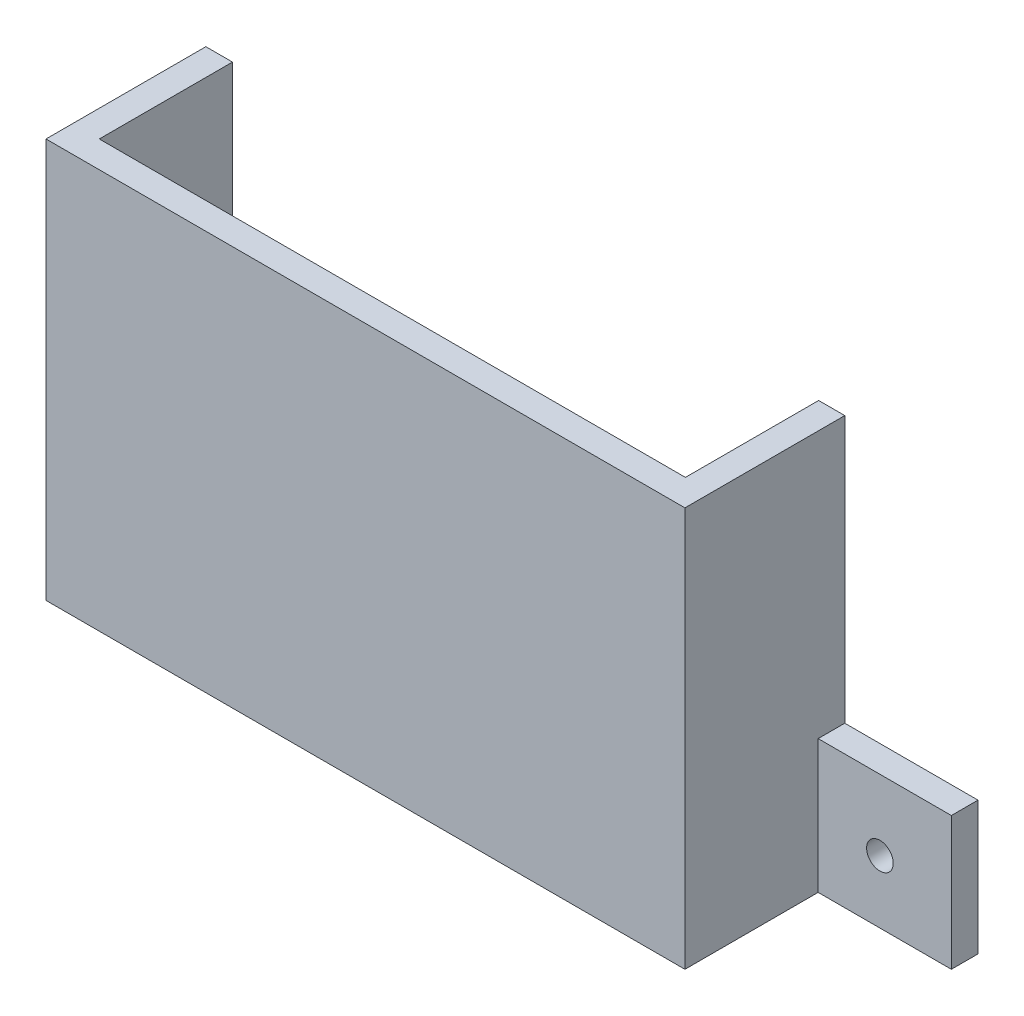
ISO-10303-21;
HEADER;
FILE_DESCRIPTION(('STEP AP214'),'2;1');
FILE_NAME('part.step','',(''),(''),'','','');
FILE_SCHEMA(('AUTOMOTIVE_DESIGN { 1 0 10303 214 1 1 1 1 }'));
ENDSEC;
DATA;
#1=APPLICATION_CONTEXT('core data for automotive mechanical design processes');
#2=APPLICATION_PROTOCOL_DEFINITION('international standard','automotive_design',2000,#1);
#3=PRODUCT_CONTEXT('',#1,'mechanical');
#4=PRODUCT('Part','Part','',(#3));
#5=PRODUCT_RELATED_PRODUCT_CATEGORY('part','',(#4));
#6=PRODUCT_DEFINITION_FORMATION('','',#4);
#7=PRODUCT_DEFINITION_CONTEXT('part definition',#1,'design');
#8=PRODUCT_DEFINITION('design','',#6,#7);
#9=PRODUCT_DEFINITION_SHAPE('','',#8);
#10=(LENGTH_UNIT() NAMED_UNIT(*) SI_UNIT(.MILLI.,.METRE.));
#11=(NAMED_UNIT(*) PLANE_ANGLE_UNIT() SI_UNIT($,.RADIAN.));
#12=(NAMED_UNIT(*) SI_UNIT($,.STERADIAN.) SOLID_ANGLE_UNIT());
#13=UNCERTAINTY_MEASURE_WITH_UNIT(LENGTH_MEASURE(1.E-05),#10,'distance_accuracy_value','');
#14=(GEOMETRIC_REPRESENTATION_CONTEXT(3) GLOBAL_UNCERTAINTY_ASSIGNED_CONTEXT((#13)) GLOBAL_UNIT_ASSIGNED_CONTEXT((#10,
#11,#12)) REPRESENTATION_CONTEXT('',''));
#15=CARTESIAN_POINT('',(0.,0.,0.));
#16=DIRECTION('',(0.,0.,1.));
#17=DIRECTION('',(1.,0.,0.));
#18=AXIS2_PLACEMENT_3D('',#15,#16,#17);
#19=CARTESIAN_POINT('',(7.43671578947368,9.99999999999999,-10.));
#20=DIRECTION('',(0.,1.,0.));
#21=DIRECTION('',(0.,0.,1.));
#22=AXIS2_PLACEMENT_3D('',#19,#20,#21);
#23=PLANE('',#22);
#24=DIRECTION('',(0.,0.,1.));
#25=VECTOR('',#24,1.);
#26=CARTESIAN_POINT('',(7.43671578947368,9.99999999999999,-10.));
#27=LINE('',#26,#25);
#28=CARTESIAN_POINT('',(7.43671578947368,9.99999999999999,-10.));
#29=VERTEX_POINT('',#28);
#30=CARTESIAN_POINT('',(7.43671578947368,9.99999999999999,-8.));
#31=VERTEX_POINT('',#30);
#32=EDGE_CURVE('E52',#29,#31,#27,.T.);
#33=ORIENTED_EDGE('',*,*,#32,.T.);
#34=DIRECTION('',(-1.,0.,0.));
#35=VECTOR('',#34,1.);
#36=CARTESIAN_POINT('',(7.43671578947368,9.99999999999999,-8.));
#37=LINE('',#36,#35);
#38=CARTESIAN_POINT('',(17.4367157894737,9.99999999999999,-8.));
#39=VERTEX_POINT('',#38);
#40=EDGE_CURVE('E180',#39,#31,#37,.T.);
#41=ORIENTED_EDGE('',*,*,#40,.F.);
#42=DIRECTION('',(0.,0.,1.));
#43=VECTOR('',#42,1.);
#44=CARTESIAN_POINT('',(17.4367157894737,9.99999999999999,-10.));
#45=LINE('',#44,#43);
#46=CARTESIAN_POINT('',(17.4367157894737,9.99999999999999,-10.));
#47=VERTEX_POINT('',#46);
#48=EDGE_CURVE('E206',#47,#39,#45,.T.);
#49=ORIENTED_EDGE('',*,*,#48,.F.);
#50=DIRECTION('',(-1.,0.,0.));
#51=VECTOR('',#50,1.);
#52=CARTESIAN_POINT('',(7.43671578947368,9.99999999999999,-10.));
#53=LINE('',#52,#51);
#54=EDGE_CURVE('E205',#47,#29,#53,.T.);
#55=ORIENTED_EDGE('',*,*,#54,.T.);
#56=EDGE_LOOP('',(#33,#41,#49,#55));
#57=FACE_BOUND('',#56,.T.);
#58=ADVANCED_FACE('F35',(#57),#23,.T.);
#59=CARTESIAN_POINT('',(17.4367157894737,9.99999999999999,-10.));
#60=DIRECTION('',(1.,0.,0.));
#61=DIRECTION('',(0.,0.,-1.));
#62=AXIS2_PLACEMENT_3D('',#59,#60,#61);
#63=PLANE('',#62);
#64=ORIENTED_EDGE('',*,*,#48,.T.);
#65=DIRECTION('',(0.,1.,0.));
#66=VECTOR('',#65,1.);
#67=CARTESIAN_POINT('',(17.4367157894737,9.99999999999999,-8.));
#68=LINE('',#67,#66);
#69=CARTESIAN_POINT('',(17.4367157894737,0.,-8.));
#70=VERTEX_POINT('',#69);
#71=EDGE_CURVE('E187',#70,#39,#68,.T.);
#72=ORIENTED_EDGE('',*,*,#71,.F.);
#73=DIRECTION('',(0.,0.,1.));
#74=VECTOR('',#73,1.);
#75=CARTESIAN_POINT('',(17.4367157894737,0.,-10.));
#76=LINE('',#75,#74);
#77=CARTESIAN_POINT('',(17.4367157894737,0.,-10.));
#78=VERTEX_POINT('',#77);
#79=EDGE_CURVE('E186',#78,#70,#76,.T.);
#80=ORIENTED_EDGE('',*,*,#79,.F.);
#81=DIRECTION('',(0.,1.,0.));
#82=VECTOR('',#81,1.);
#83=CARTESIAN_POINT('',(17.4367157894737,9.99999999999999,-10.));
#84=LINE('',#83,#82);
#85=EDGE_CURVE('E202',#78,#47,#84,.T.);
#86=ORIENTED_EDGE('',*,*,#85,.T.);
#87=EDGE_LOOP('',(#64,#72,#80,#86));
#88=FACE_BOUND('',#87,.T.);
#89=ADVANCED_FACE('F334',(#88),#63,.T.);
#90=CARTESIAN_POINT('',(7.43671578947368,30.,2.));
#91=DIRECTION('',(-1.,0.,0.));
#92=DIRECTION('',(0.,0.,1.));
#93=AXIS2_PLACEMENT_3D('',#90,#91,#92);
#94=PLANE('',#93);
#95=DIRECTION('',(0.,0.,-1.));
#96=VECTOR('',#95,1.);
#97=CARTESIAN_POINT('',(7.43671578947368,0.,2.));
#98=LINE('',#97,#96);
#99=CARTESIAN_POINT('',(7.43671578947368,0.,2.));
#100=VERTEX_POINT('',#99);
#101=CARTESIAN_POINT('',(7.43671578947368,0.,-8.));
#102=VERTEX_POINT('',#101);
#103=EDGE_CURVE('E162',#100,#102,#98,.T.);
#104=ORIENTED_EDGE('',*,*,#103,.T.);
#105=DIRECTION('',(0.,-1.,0.));
#106=VECTOR('',#105,1.);
#107=CARTESIAN_POINT('',(7.43671578947368,9.99999999999999,-8.));
#108=LINE('',#107,#106);
#109=EDGE_CURVE('E165',#31,#102,#108,.T.);
#110=ORIENTED_EDGE('',*,*,#109,.F.);
#111=ORIENTED_EDGE('',*,*,#32,.F.);
#112=DIRECTION('',(0.,-1.,0.));
#113=VECTOR('',#112,1.);
#114=CARTESIAN_POINT('',(7.43671578947368,30.,-10.));
#115=LINE('',#114,#113);
#116=CARTESIAN_POINT('',(7.43671578947368,30.,-10.));
#117=VERTEX_POINT('',#116);
#118=EDGE_CURVE('E292',#117,#29,#115,.T.);
#119=ORIENTED_EDGE('',*,*,#118,.F.);
#120=DIRECTION('',(0.,0.,-1.));
#121=VECTOR('',#120,1.);
#122=CARTESIAN_POINT('',(7.43671578947368,30.,2.));
#123=LINE('',#122,#121);
#124=CARTESIAN_POINT('',(7.43671578947368,30.,2.));
#125=VERTEX_POINT('',#124);
#126=EDGE_CURVE('E260',#125,#117,#123,.T.);
#127=ORIENTED_EDGE('',*,*,#126,.F.);
#128=DIRECTION('',(0.,-1.,0.));
#129=VECTOR('',#128,1.);
#130=CARTESIAN_POINT('',(7.43671578947368,30.,2.));
#131=LINE('',#130,#129);
#132=EDGE_CURVE('E169',#125,#100,#131,.T.);
#133=ORIENTED_EDGE('',*,*,#132,.T.);
#134=EDGE_LOOP('',(#104,#110,#111,#119,#127,#133));
#135=FACE_BOUND('',#134,.T.);
#136=ADVANCED_FACE('F164',(#135),#94,.F.);
#137=CARTESIAN_POINT('',(-38.5263157894737,30.,0.));
#138=DIRECTION('',(0.,0.,-1.));
#139=DIRECTION('',(-1.,0.,0.));
#140=AXIS2_PLACEMENT_3D('',#137,#138,#139);
#141=PLANE('',#140);
#142=DIRECTION('',(1.,0.,0.));
#143=VECTOR('',#142,1.);
#144=CARTESIAN_POINT('',(-26.5632842105263,2.,0.));
#145=LINE('',#144,#143);
#146=CARTESIAN_POINT('',(-26.5632842105263,2.,0.));
#147=VERTEX_POINT('',#146);
#148=CARTESIAN_POINT('',(-6.56328421052632,2.,0.));
#149=VERTEX_POINT('',#148);
#150=EDGE_CURVE('E236',#147,#149,#145,.T.);
#151=ORIENTED_EDGE('',*,*,#150,.F.);
#152=DIRECTION('',(0.,1.,0.));
#153=VECTOR('',#152,1.);
#154=CARTESIAN_POINT('',(-26.5632842105263,0.,0.));
#155=LINE('',#154,#153);
#156=CARTESIAN_POINT('',(-26.5632842105263,0.,0.));
#157=VERTEX_POINT('',#156);
#158=EDGE_CURVE('E218',#157,#147,#155,.T.);
#159=ORIENTED_EDGE('',*,*,#158,.F.);
#160=DIRECTION('',(1.,0.,0.));
#161=VECTOR('',#160,1.);
#162=CARTESIAN_POINT('',(-38.5263157894737,0.,0.));
#163=LINE('',#162,#161);
#164=CARTESIAN_POINT('',(-38.5263157894737,0.,0.));
#165=VERTEX_POINT('',#164);
#166=EDGE_CURVE('E252',#165,#157,#163,.T.);
#167=ORIENTED_EDGE('',*,*,#166,.F.);
#168=DIRECTION('',(0.,-1.,0.));
#169=VECTOR('',#168,1.);
#170=CARTESIAN_POINT('',(-38.5263157894737,30.,0.));
#171=LINE('',#170,#169);
#172=CARTESIAN_POINT('',(-38.5263157894737,30.,0.));
#173=VERTEX_POINT('',#172);
#174=EDGE_CURVE('E271',#173,#165,#171,.T.);
#175=ORIENTED_EDGE('',*,*,#174,.F.);
#176=DIRECTION('',(1.,0.,0.));
#177=VECTOR('',#176,1.);
#178=CARTESIAN_POINT('',(-38.5263157894737,30.,0.));
#179=LINE('',#178,#177);
#180=CARTESIAN_POINT('',(5.47368421052631,30.,0.));
#181=VERTEX_POINT('',#180);
#182=EDGE_CURVE('E268',#173,#181,#179,.T.);
#183=ORIENTED_EDGE('',*,*,#182,.T.);
#184=DIRECTION('',(0.,-1.,0.));
#185=VECTOR('',#184,1.);
#186=CARTESIAN_POINT('',(5.47368421052631,30.,0.));
#187=LINE('',#186,#185);
#188=CARTESIAN_POINT('',(5.47368421052631,0.,0.));
#189=VERTEX_POINT('',#188);
#190=EDGE_CURVE('E425',#181,#189,#187,.T.);
#191=ORIENTED_EDGE('',*,*,#190,.T.);
#192=CARTESIAN_POINT('',(-6.56328421052632,0.,0.));
#193=VERTEX_POINT('',#192);
#194=EDGE_CURVE('E433',#193,#189,#163,.T.);
#195=ORIENTED_EDGE('',*,*,#194,.F.);
#196=DIRECTION('',(0.,1.,0.));
#197=VECTOR('',#196,1.);
#198=CARTESIAN_POINT('',(-6.56328421052632,0.,0.));
#199=LINE('',#198,#197);
#200=EDGE_CURVE('E60',#193,#149,#199,.T.);
#201=ORIENTED_EDGE('',*,*,#200,.T.);
#202=EDGE_LOOP('',(#151,#159,#167,#175,#183,#191,#195,#201));
#203=FACE_BOUND('',#202,.T.);
#204=ADVANCED_FACE('F372',(#203),#141,.T.);
#205=CARTESIAN_POINT('',(-38.5263157894737,30.,0.));
#206=DIRECTION('',(-1.,0.,0.));
#207=DIRECTION('',(0.,0.,1.));
#208=AXIS2_PLACEMENT_3D('',#205,#206,#207);
#209=PLANE('',#208);
#210=DIRECTION('',(0.,0.,-1.));
#211=VECTOR('',#210,1.);
#212=CARTESIAN_POINT('',(-38.5263157894737,0.,0.));
#213=LINE('',#212,#211);
#214=CARTESIAN_POINT('',(-38.5263157894737,0.,-10.));
#215=VERTEX_POINT('',#214);
#216=EDGE_CURVE('E247',#165,#215,#213,.T.);
#217=ORIENTED_EDGE('',*,*,#216,.T.);
#218=DIRECTION('',(0.,-1.,0.));
#219=VECTOR('',#218,1.);
#220=CARTESIAN_POINT('',(-38.5263157894737,30.,-10.));
#221=LINE('',#220,#219);
#222=CARTESIAN_POINT('',(-38.5263157894737,30.,-10.));
#223=VERTEX_POINT('',#222);
#224=EDGE_CURVE('E11',#223,#215,#221,.T.);
#225=ORIENTED_EDGE('',*,*,#224,.F.);
#226=DIRECTION('',(0.,0.,-1.));
#227=VECTOR('',#226,1.);
#228=CARTESIAN_POINT('',(-38.5263157894737,30.,0.));
#229=LINE('',#228,#227);
#230=EDGE_CURVE('E248',#173,#223,#229,.T.);
#231=ORIENTED_EDGE('',*,*,#230,.F.);
#232=ORIENTED_EDGE('',*,*,#174,.T.);
#233=EDGE_LOOP('',(#217,#225,#231,#232));
#234=FACE_BOUND('',#233,.T.);
#235=ADVANCED_FACE('F37',(#234),#209,.F.);
#236=CARTESIAN_POINT('',(-38.5263157894737,30.,-10.));
#237=DIRECTION('',(0.,0.,1.));
#238=DIRECTION('',(1.,0.,0.));
#239=AXIS2_PLACEMENT_3D('',#236,#237,#238);
#240=PLANE('',#239);
#241=CARTESIAN_POINT('',(-45.8676738775354,4.7068804025775,-10.));
#242=DIRECTION('',(0.,0.,1.));
#243=DIRECTION('',(1.,0.,0.));
#244=AXIS2_PLACEMENT_3D('',#241,#242,#243);
#245=CIRCLE('',#244,0.999999999999998);
#246=CARTESIAN_POINT('',(-44.8676738775354,4.7068804025775,-10.));
#247=VERTEX_POINT('',#246);
#248=EDGE_CURVE('E181',#247,#247,#245,.T.);
#249=ORIENTED_EDGE('',*,*,#248,.T.);
#250=EDGE_LOOP('',(#249));
#251=FACE_BOUND('',#250,.T.);
#252=DIRECTION('',(-1.,0.,0.));
#253=VECTOR('',#252,1.);
#254=CARTESIAN_POINT('',(-38.5263157894737,0.,-10.));
#255=LINE('',#254,#253);
#256=CARTESIAN_POINT('',(-50.5263157894737,0.,-10.));
#257=VERTEX_POINT('',#256);
#258=EDGE_CURVE('E274',#215,#257,#255,.T.);
#259=ORIENTED_EDGE('',*,*,#258,.T.);
#260=DIRECTION('',(0.,-1.,0.));
#261=VECTOR('',#260,1.);
#262=CARTESIAN_POINT('',(-50.5263157894737,10.,-10.));
#263=LINE('',#262,#261);
#264=CARTESIAN_POINT('',(-50.5263157894737,10.,-10.));
#265=VERTEX_POINT('',#264);
#266=EDGE_CURVE('E210',#265,#257,#263,.T.);
#267=ORIENTED_EDGE('',*,*,#266,.F.);
#268=DIRECTION('',(-1.,0.,0.));
#269=VECTOR('',#268,1.);
#270=CARTESIAN_POINT('',(-40.5263157894737,10.,-10.));
#271=LINE('',#270,#269);
#272=CARTESIAN_POINT('',(-40.5263157894737,10.,-10.));
#273=VERTEX_POINT('',#272);
#274=EDGE_CURVE('E214',#273,#265,#271,.T.);
#275=ORIENTED_EDGE('',*,*,#274,.F.);
#276=DIRECTION('',(0.,-1.,0.));
#277=VECTOR('',#276,1.);
#278=CARTESIAN_POINT('',(-40.5263157894737,30.,-10.));
#279=LINE('',#278,#277);
#280=CARTESIAN_POINT('',(-40.5263157894737,30.,-10.));
#281=VERTEX_POINT('',#280);
#282=EDGE_CURVE('E44',#281,#273,#279,.T.);
#283=ORIENTED_EDGE('',*,*,#282,.F.);
#284=DIRECTION('',(-1.,0.,0.));
#285=VECTOR('',#284,1.);
#286=CARTESIAN_POINT('',(-38.5263157894737,30.,-10.));
#287=LINE('',#286,#285);
#288=EDGE_CURVE('E251',#223,#281,#287,.T.);
#289=ORIENTED_EDGE('',*,*,#288,.F.);
#290=ORIENTED_EDGE('',*,*,#224,.T.);
#291=EDGE_LOOP('',(#259,#267,#275,#283,#289,#290));
#292=FACE_BOUND('',#291,.T.);
#293=ADVANCED_FACE('F391',(#251,#292),#240,.F.);
#294=CARTESIAN_POINT('',(-40.5263157894737,30.,2.));
#295=DIRECTION('',(-1.,0.,0.));
#296=DIRECTION('',(0.,0.,1.));
#297=AXIS2_PLACEMENT_3D('',#294,#295,#296);
#298=PLANE('',#297);
#299=DIRECTION('',(0.,0.,1.));
#300=VECTOR('',#299,1.);
#301=CARTESIAN_POINT('',(-40.5263157894737,10.,-10.));
#302=LINE('',#301,#300);
#303=CARTESIAN_POINT('',(-40.5263157894737,10.,-8.));
#304=VERTEX_POINT('',#303);
#305=EDGE_CURVE('E213',#273,#304,#302,.T.);
#306=ORIENTED_EDGE('',*,*,#305,.T.);
#307=DIRECTION('',(0.,1.,0.));
#308=VECTOR('',#307,1.);
#309=CARTESIAN_POINT('',(-40.5263157894737,10.,-8.));
#310=LINE('',#309,#308);
#311=CARTESIAN_POINT('',(-40.5263157894737,0.,-8.));
#312=VERTEX_POINT('',#311);
#313=EDGE_CURVE('E193',#312,#304,#310,.T.);
#314=ORIENTED_EDGE('',*,*,#313,.F.);
#315=DIRECTION('',(0.,0.,-1.));
#316=VECTOR('',#315,1.);
#317=CARTESIAN_POINT('',(-40.5263157894737,0.,2.));
#318=LINE('',#317,#316);
#319=CARTESIAN_POINT('',(-40.5263157894737,0.,2.));
#320=VERTEX_POINT('',#319);
#321=EDGE_CURVE('E276',#320,#312,#318,.T.);
#322=ORIENTED_EDGE('',*,*,#321,.F.);
#323=DIRECTION('',(0.,-1.,0.));
#324=VECTOR('',#323,1.);
#325=CARTESIAN_POINT('',(-40.5263157894737,30.,2.));
#326=LINE('',#325,#324);
#327=CARTESIAN_POINT('',(-40.5263157894737,30.,2.));
#328=VERTEX_POINT('',#327);
#329=EDGE_CURVE('E285',#328,#320,#326,.T.);
#330=ORIENTED_EDGE('',*,*,#329,.F.);
#331=DIRECTION('',(0.,0.,-1.));
#332=VECTOR('',#331,1.);
#333=CARTESIAN_POINT('',(-40.5263157894737,30.,2.));
#334=LINE('',#333,#332);
#335=EDGE_CURVE('E254',#328,#281,#334,.T.);
#336=ORIENTED_EDGE('',*,*,#335,.T.);
#337=ORIENTED_EDGE('',*,*,#282,.T.);
#338=EDGE_LOOP('',(#306,#314,#322,#330,#336,#337));
#339=FACE_BOUND('',#338,.T.);
#340=ADVANCED_FACE('F388',(#339),#298,.T.);
#341=CARTESIAN_POINT('',(5.47368421052631,30.,2.));
#342=DIRECTION('',(0.,0.,-1.));
#343=DIRECTION('',(-1.,0.,0.));
#344=AXIS2_PLACEMENT_3D('',#341,#342,#343);
#345=PLANE('',#344);
#346=DIRECTION('',(1.,0.,0.));
#347=VECTOR('',#346,1.);
#348=CARTESIAN_POINT('',(5.47368421052631,0.,2.));
#349=LINE('',#348,#347);
#350=EDGE_CURVE('E173',#320,#100,#349,.T.);
#351=ORIENTED_EDGE('',*,*,#350,.T.);
#352=ORIENTED_EDGE('',*,*,#132,.F.);
#353=DIRECTION('',(-1.,0.,0.));
#354=VECTOR('',#353,1.);
#355=CARTESIAN_POINT('',(-38.5263157894737,30.,2.));
#356=LINE('',#355,#354);
#357=EDGE_CURVE('E257',#125,#328,#356,.T.);
#358=ORIENTED_EDGE('',*,*,#357,.T.);
#359=ORIENTED_EDGE('',*,*,#329,.T.);
#360=EDGE_LOOP('',(#351,#352,#358,#359));
#361=FACE_BOUND('',#360,.T.);
#362=ADVANCED_FACE('F382',(#361),#345,.F.);
#363=CARTESIAN_POINT('',(5.47368421052631,30.,-10.));
#364=DIRECTION('',(0.,0.,-1.));
#365=DIRECTION('',(-1.,0.,0.));
#366=AXIS2_PLACEMENT_3D('',#363,#364,#365);
#367=PLANE('',#366);
#368=CARTESIAN_POINT('',(12.0751282708822,4.7068804025775,-10.));
#369=DIRECTION('',(0.,0.,-1.));
#370=DIRECTION('',(-1.,0.,0.));
#371=AXIS2_PLACEMENT_3D('',#368,#369,#370);
#372=CIRCLE('',#371,1.);
#373=CARTESIAN_POINT('',(11.0751282708822,4.7068804025775,-10.));
#374=VERTEX_POINT('',#373);
#375=EDGE_CURVE('E308',#374,#374,#372,.T.);
#376=ORIENTED_EDGE('',*,*,#375,.F.);
#377=EDGE_LOOP('',(#376));
#378=FACE_BOUND('',#377,.T.);
#379=DIRECTION('',(1.,0.,0.));
#380=VECTOR('',#379,1.);
#381=CARTESIAN_POINT('',(5.47368421052631,0.,-10.));
#382=LINE('',#381,#380);
#383=CARTESIAN_POINT('',(5.47368421052631,0.,-10.));
#384=VERTEX_POINT('',#383);
#385=EDGE_CURVE('E172',#384,#78,#382,.T.);
#386=ORIENTED_EDGE('',*,*,#385,.F.);
#387=DIRECTION('',(0.,-1.,0.));
#388=VECTOR('',#387,1.);
#389=CARTESIAN_POINT('',(5.47368421052631,30.,-10.));
#390=LINE('',#389,#388);
#391=CARTESIAN_POINT('',(5.47368421052631,30.,-10.));
#392=VERTEX_POINT('',#391);
#393=EDGE_CURVE('E295',#392,#384,#390,.T.);
#394=ORIENTED_EDGE('',*,*,#393,.F.);
#395=DIRECTION('',(1.,0.,0.));
#396=VECTOR('',#395,1.);
#397=CARTESIAN_POINT('',(5.47368421052631,30.,-10.));
#398=LINE('',#397,#396);
#399=EDGE_CURVE('E262',#392,#117,#398,.T.);
#400=ORIENTED_EDGE('',*,*,#399,.T.);
#401=ORIENTED_EDGE('',*,*,#118,.T.);
#402=ORIENTED_EDGE('',*,*,#54,.F.);
#403=ORIENTED_EDGE('',*,*,#85,.F.);
#404=EDGE_LOOP('',(#386,#394,#400,#401,#402,#403));
#405=FACE_BOUND('',#404,.T.);
#406=ADVANCED_FACE('F378',(#378,#405),#367,.T.);
#407=CARTESIAN_POINT('',(5.47368421052631,30.,0.));
#408=DIRECTION('',(-1.,0.,0.));
#409=DIRECTION('',(0.,0.,1.));
#410=AXIS2_PLACEMENT_3D('',#407,#408,#409);
#411=PLANE('',#410);
#412=DIRECTION('',(0.,0.,-1.));
#413=VECTOR('',#412,1.);
#414=CARTESIAN_POINT('',(5.47368421052631,0.,0.));
#415=LINE('',#414,#413);
#416=EDGE_CURVE('E427',#189,#384,#415,.T.);
#417=ORIENTED_EDGE('',*,*,#416,.F.);
#418=ORIENTED_EDGE('',*,*,#190,.F.);
#419=DIRECTION('',(0.,0.,-1.));
#420=VECTOR('',#419,1.);
#421=CARTESIAN_POINT('',(5.47368421052631,30.,0.));
#422=LINE('',#421,#420);
#423=EDGE_CURVE('E265',#181,#392,#422,.T.);
#424=ORIENTED_EDGE('',*,*,#423,.T.);
#425=ORIENTED_EDGE('',*,*,#393,.T.);
#426=EDGE_LOOP('',(#417,#418,#424,#425));
#427=FACE_BOUND('',#426,.T.);
#428=ADVANCED_FACE('F368',(#427),#411,.T.);
#429=CARTESIAN_POINT('',(0.,30.,0.));
#430=DIRECTION('',(0.,1.,0.));
#431=DIRECTION('',(0.,0.,1.));
#432=AXIS2_PLACEMENT_3D('',#429,#430,#431);
#433=PLANE('',#432);
#434=ORIENTED_EDGE('',*,*,#230,.T.);
#435=ORIENTED_EDGE('',*,*,#288,.T.);
#436=ORIENTED_EDGE('',*,*,#335,.F.);
#437=ORIENTED_EDGE('',*,*,#357,.F.);
#438=ORIENTED_EDGE('',*,*,#126,.T.);
#439=ORIENTED_EDGE('',*,*,#399,.F.);
#440=ORIENTED_EDGE('',*,*,#423,.F.);
#441=ORIENTED_EDGE('',*,*,#182,.F.);
#442=EDGE_LOOP('',(#434,#435,#436,#437,#438,#439,#440,#441));
#443=FACE_BOUND('',#442,.T.);
#444=ADVANCED_FACE('F365',(#443),#433,.T.);
#445=CARTESIAN_POINT('',(0.,0.,0.));
#446=DIRECTION('',(0.,1.,0.));
#447=DIRECTION('',(0.,0.,1.));
#448=AXIS2_PLACEMENT_3D('',#445,#446,#447);
#449=PLANE('',#448);
#450=DIRECTION('',(1.,0.,0.));
#451=VECTOR('',#450,1.);
#452=CARTESIAN_POINT('',(7.43671578947368,0.,-8.));
#453=LINE('',#452,#451);
#454=EDGE_CURVE('E177',#102,#70,#453,.T.);
#455=ORIENTED_EDGE('',*,*,#454,.F.);
#456=ORIENTED_EDGE('',*,*,#103,.F.);
#457=ORIENTED_EDGE('',*,*,#350,.F.);
#458=ORIENTED_EDGE('',*,*,#321,.T.);
#459=DIRECTION('',(1.,0.,0.));
#460=VECTOR('',#459,1.);
#461=CARTESIAN_POINT('',(-40.5263157894737,0.,-8.));
#462=LINE('',#461,#460);
#463=CARTESIAN_POINT('',(-50.5263157894737,0.,-8.));
#464=VERTEX_POINT('',#463);
#465=EDGE_CURVE('E199',#464,#312,#462,.T.);
#466=ORIENTED_EDGE('',*,*,#465,.F.);
#467=DIRECTION('',(0.,0.,1.));
#468=VECTOR('',#467,1.);
#469=CARTESIAN_POINT('',(-50.5263157894737,0.,-10.));
#470=LINE('',#469,#468);
#471=EDGE_CURVE('E215',#257,#464,#470,.T.);
#472=ORIENTED_EDGE('',*,*,#471,.F.);
#473=ORIENTED_EDGE('',*,*,#258,.F.);
#474=ORIENTED_EDGE('',*,*,#216,.F.);
#475=ORIENTED_EDGE('',*,*,#166,.T.);
#476=DIRECTION('',(0.,0.,1.));
#477=VECTOR('',#476,1.);
#478=CARTESIAN_POINT('',(-26.5632842105263,0.,-6.));
#479=LINE('',#478,#477);
#480=CARTESIAN_POINT('',(-26.5632842105263,0.,-6.));
#481=VERTEX_POINT('',#480);
#482=EDGE_CURVE('E233',#481,#157,#479,.T.);
#483=ORIENTED_EDGE('',*,*,#482,.F.);
#484=DIRECTION('',(1.,0.,0.));
#485=VECTOR('',#484,1.);
#486=CARTESIAN_POINT('',(-26.5632842105263,0.,-6.));
#487=LINE('',#486,#485);
#488=CARTESIAN_POINT('',(-6.56328421052632,0.,-6.));
#489=VERTEX_POINT('',#488);
#490=EDGE_CURVE('E230',#481,#489,#487,.T.);
#491=ORIENTED_EDGE('',*,*,#490,.T.);
#492=DIRECTION('',(0.,0.,1.));
#493=VECTOR('',#492,1.);
#494=CARTESIAN_POINT('',(-6.56328421052632,0.,-6.));
#495=LINE('',#494,#493);
#496=EDGE_CURVE('E241',#489,#193,#495,.T.);
#497=ORIENTED_EDGE('',*,*,#496,.T.);
#498=ORIENTED_EDGE('',*,*,#194,.T.);
#499=ORIENTED_EDGE('',*,*,#416,.T.);
#500=ORIENTED_EDGE('',*,*,#385,.T.);
#501=ORIENTED_EDGE('',*,*,#79,.T.);
#502=EDGE_LOOP('',(#455,#456,#457,#458,#466,#472,#473,#474,#475,#483,#491,#497,#498,#499,#500,#501));
#503=FACE_BOUND('',#502,.T.);
#504=ADVANCED_FACE('F184',(#503),#449,.F.);
#505=CARTESIAN_POINT('',(-26.5632842105263,0.,-6.));
#506=DIRECTION('',(1.,0.,0.));
#507=DIRECTION('',(0.,0.,-1.));
#508=AXIS2_PLACEMENT_3D('',#505,#506,#507);
#509=PLANE('',#508);
#510=ORIENTED_EDGE('',*,*,#158,.T.);
#511=DIRECTION('',(0.,0.,1.));
#512=VECTOR('',#511,1.);
#513=CARTESIAN_POINT('',(-26.5632842105263,2.,-6.));
#514=LINE('',#513,#512);
#515=CARTESIAN_POINT('',(-26.5632842105263,2.,-6.));
#516=VERTEX_POINT('',#515);
#517=EDGE_CURVE('E245',#516,#147,#514,.T.);
#518=ORIENTED_EDGE('',*,*,#517,.F.);
#519=DIRECTION('',(0.,1.,0.));
#520=VECTOR('',#519,1.);
#521=CARTESIAN_POINT('',(-26.5632842105263,0.,-6.));
#522=LINE('',#521,#520);
#523=EDGE_CURVE('E222',#481,#516,#522,.T.);
#524=ORIENTED_EDGE('',*,*,#523,.F.);
#525=ORIENTED_EDGE('',*,*,#482,.T.);
#526=EDGE_LOOP('',(#510,#518,#524,#525));
#527=FACE_BOUND('',#526,.T.);
#528=ADVANCED_FACE('F360',(#527),#509,.F.);
#529=CARTESIAN_POINT('',(-26.5632842105263,2.,-6.));
#530=DIRECTION('',(0.,-1.,0.));
#531=DIRECTION('',(0.,0.,-1.));
#532=AXIS2_PLACEMENT_3D('',#529,#530,#531);
#533=PLANE('',#532);
#534=ORIENTED_EDGE('',*,*,#150,.T.);
#535=DIRECTION('',(0.,0.,1.));
#536=VECTOR('',#535,1.);
#537=CARTESIAN_POINT('',(-6.56328421052632,2.,-6.));
#538=LINE('',#537,#536);
#539=CARTESIAN_POINT('',(-6.56328421052632,2.,-6.));
#540=VERTEX_POINT('',#539);
#541=EDGE_CURVE('E243',#540,#149,#538,.T.);
#542=ORIENTED_EDGE('',*,*,#541,.F.);
#543=DIRECTION('',(1.,0.,0.));
#544=VECTOR('',#543,1.);
#545=CARTESIAN_POINT('',(-26.5632842105263,2.,-6.));
#546=LINE('',#545,#544);
#547=EDGE_CURVE('E225',#516,#540,#546,.T.);
#548=ORIENTED_EDGE('',*,*,#547,.F.);
#549=ORIENTED_EDGE('',*,*,#517,.T.);
#550=EDGE_LOOP('',(#534,#542,#548,#549));
#551=FACE_BOUND('',#550,.T.);
#552=ADVANCED_FACE('F357',(#551),#533,.F.);
#553=CARTESIAN_POINT('',(-6.56328421052632,0.,-6.));
#554=DIRECTION('',(1.,0.,0.));
#555=DIRECTION('',(0.,0.,-1.));
#556=AXIS2_PLACEMENT_3D('',#553,#554,#555);
#557=PLANE('',#556);
#558=ORIENTED_EDGE('',*,*,#200,.F.);
#559=ORIENTED_EDGE('',*,*,#496,.F.);
#560=DIRECTION('',(0.,1.,0.));
#561=VECTOR('',#560,1.);
#562=CARTESIAN_POINT('',(-6.56328421052632,0.,-6.));
#563=LINE('',#562,#561);
#564=EDGE_CURVE('E227',#489,#540,#563,.T.);
#565=ORIENTED_EDGE('',*,*,#564,.T.);
#566=ORIENTED_EDGE('',*,*,#541,.T.);
#567=EDGE_LOOP('',(#558,#559,#565,#566));
#568=FACE_BOUND('',#567,.T.);
#569=ADVANCED_FACE('F353',(#568),#557,.T.);
#570=CARTESIAN_POINT('',(0.,0.,-6.));
#571=DIRECTION('',(0.,0.,-1.));
#572=DIRECTION('',(-1.,0.,0.));
#573=AXIS2_PLACEMENT_3D('',#570,#571,#572);
#574=PLANE('',#573);
#575=ORIENTED_EDGE('',*,*,#523,.T.);
#576=ORIENTED_EDGE('',*,*,#547,.T.);
#577=ORIENTED_EDGE('',*,*,#564,.F.);
#578=ORIENTED_EDGE('',*,*,#490,.F.);
#579=EDGE_LOOP('',(#575,#576,#577,#578));
#580=FACE_BOUND('',#579,.T.);
#581=ADVANCED_FACE('F347',(#580),#574,.T.);
#582=CARTESIAN_POINT('',(-50.5263157894737,10.,-10.));
#583=DIRECTION('',(-1.,0.,0.));
#584=DIRECTION('',(0.,0.,1.));
#585=AXIS2_PLACEMENT_3D('',#582,#583,#584);
#586=PLANE('',#585);
#587=DIRECTION('',(0.,-1.,0.));
#588=VECTOR('',#587,1.);
#589=CARTESIAN_POINT('',(-50.5263157894737,10.,-8.));
#590=LINE('',#589,#588);
#591=CARTESIAN_POINT('',(-50.5263157894737,10.,-8.));
#592=VERTEX_POINT('',#591);
#593=EDGE_CURVE('E197',#592,#464,#590,.T.);
#594=ORIENTED_EDGE('',*,*,#593,.F.);
#595=DIRECTION('',(0.,0.,1.));
#596=VECTOR('',#595,1.);
#597=CARTESIAN_POINT('',(-50.5263157894737,10.,-10.));
#598=LINE('',#597,#596);
#599=EDGE_CURVE('E219',#265,#592,#598,.T.);
#600=ORIENTED_EDGE('',*,*,#599,.F.);
#601=ORIENTED_EDGE('',*,*,#266,.T.);
#602=ORIENTED_EDGE('',*,*,#471,.T.);
#603=EDGE_LOOP('',(#594,#600,#601,#602));
#604=FACE_BOUND('',#603,.T.);
#605=ADVANCED_FACE('F344',(#604),#586,.T.);
#606=CARTESIAN_POINT('',(-40.5263157894737,10.,-10.));
#607=DIRECTION('',(0.,1.,0.));
#608=DIRECTION('',(-1.,0.,0.));
#609=AXIS2_PLACEMENT_3D('',#606,#607,#608);
#610=PLANE('',#609);
#611=DIRECTION('',(-1.,0.,0.));
#612=VECTOR('',#611,1.);
#613=CARTESIAN_POINT('',(-40.5263157894737,10.,-8.));
#614=LINE('',#613,#612);
#615=EDGE_CURVE('E195',#304,#592,#614,.T.);
#616=ORIENTED_EDGE('',*,*,#615,.F.);
#617=ORIENTED_EDGE('',*,*,#305,.F.);
#618=ORIENTED_EDGE('',*,*,#274,.T.);
#619=ORIENTED_EDGE('',*,*,#599,.T.);
#620=EDGE_LOOP('',(#616,#617,#618,#619));
#621=FACE_BOUND('',#620,.T.);
#622=ADVANCED_FACE('F331',(#621),#610,.T.);
#623=CARTESIAN_POINT('',(0.,0.,-8.));
#624=DIRECTION('',(0.,0.,-1.));
#625=DIRECTION('',(-1.,0.,0.));
#626=AXIS2_PLACEMENT_3D('',#623,#624,#625);
#627=PLANE('',#626);
#628=CARTESIAN_POINT('',(-45.8676738775354,4.7068804025775,-8.));
#629=DIRECTION('',(0.,0.,-1.));
#630=DIRECTION('',(-1.,0.,0.));
#631=AXIS2_PLACEMENT_3D('',#628,#629,#630);
#632=CIRCLE('',#631,0.999999999999998);
#633=CARTESIAN_POINT('',(-46.8676738775354,4.7068804025775,-8.));
#634=VERTEX_POINT('',#633);
#635=EDGE_CURVE('E306',#634,#634,#632,.T.);
#636=ORIENTED_EDGE('',*,*,#635,.T.);
#637=EDGE_LOOP('',(#636));
#638=FACE_BOUND('',#637,.T.);
#639=ORIENTED_EDGE('',*,*,#313,.T.);
#640=ORIENTED_EDGE('',*,*,#615,.T.);
#641=ORIENTED_EDGE('',*,*,#593,.T.);
#642=ORIENTED_EDGE('',*,*,#465,.T.);
#643=EDGE_LOOP('',(#639,#640,#641,#642));
#644=FACE_BOUND('',#643,.T.);
#645=ADVANCED_FACE('F323',(#638,#644),#627,.F.);
#646=CARTESIAN_POINT('',(0.,0.,-8.));
#647=DIRECTION('',(0.,0.,1.));
#648=DIRECTION('',(1.,0.,0.));
#649=AXIS2_PLACEMENT_3D('',#646,#647,#648);
#650=PLANE('',#649);
#651=CARTESIAN_POINT('',(12.0751282708822,4.7068804025775,-8.));
#652=DIRECTION('',(0.,0.,1.));
#653=DIRECTION('',(1.,0.,0.));
#654=AXIS2_PLACEMENT_3D('',#651,#652,#653);
#655=CIRCLE('',#654,1.);
#656=CARTESIAN_POINT('',(13.0751282708822,4.7068804025775,-8.));
#657=VERTEX_POINT('',#656);
#658=EDGE_CURVE('E39',#657,#657,#655,.T.);
#659=ORIENTED_EDGE('',*,*,#658,.F.);
#660=EDGE_LOOP('',(#659));
#661=FACE_BOUND('',#660,.T.);
#662=ORIENTED_EDGE('',*,*,#109,.T.);
#663=ORIENTED_EDGE('',*,*,#454,.T.);
#664=ORIENTED_EDGE('',*,*,#71,.T.);
#665=ORIENTED_EDGE('',*,*,#40,.T.);
#666=EDGE_LOOP('',(#662,#663,#664,#665));
#667=FACE_BOUND('',#666,.T.);
#668=ADVANCED_FACE('F176',(#661,#667),#650,.T.);
#669=CARTESIAN_POINT('',(-45.8676738775354,4.7068804025775,-15.));
#670=DIRECTION('',(0.,0.,1.));
#671=DIRECTION('',(1.,0.,0.));
#672=AXIS2_PLACEMENT_3D('',#669,#670,#671);
#673=CYLINDRICAL_SURFACE('',#672,0.999999999999998);
#674=ORIENTED_EDGE('',*,*,#635,.F.);
#675=EDGE_LOOP('',(#674));
#676=FACE_BOUND('',#675,.T.);
#677=ORIENTED_EDGE('',*,*,#248,.F.);
#678=EDGE_LOOP('',(#677));
#679=FACE_BOUND('',#678,.T.);
#680=ADVANCED_FACE('F322',(#676,#679),#673,.F.);
#681=CARTESIAN_POINT('',(12.0751282708822,4.7068804025775,-15.));
#682=DIRECTION('',(0.,0.,1.));
#683=DIRECTION('',(1.,0.,0.));
#684=AXIS2_PLACEMENT_3D('',#681,#682,#683);
#685=CYLINDRICAL_SURFACE('',#684,1.);
#686=ORIENTED_EDGE('',*,*,#375,.T.);
#687=EDGE_LOOP('',(#686));
#688=FACE_BOUND('',#687,.T.);
#689=ORIENTED_EDGE('',*,*,#658,.T.);
#690=EDGE_LOOP('',(#689));
#691=FACE_BOUND('',#690,.T.);
#692=ADVANCED_FACE('F319',(#688,#691),#685,.F.);
#693=CLOSED_SHELL('',(#58,#89,#136,#204,#235,#293,#340,#362,#406,#428,#444,#504,#528,#552,#569,
#581,#605,#622,#645,#668,#680,#692));
#694=MANIFOLD_SOLID_BREP('B2',#693);
#695=ADVANCED_BREP_SHAPE_REPRESENTATION('',(#18,#694),#14);
#696=SHAPE_DEFINITION_REPRESENTATION(#9,#695);
ENDSEC;
END-ISO-10303-21;
